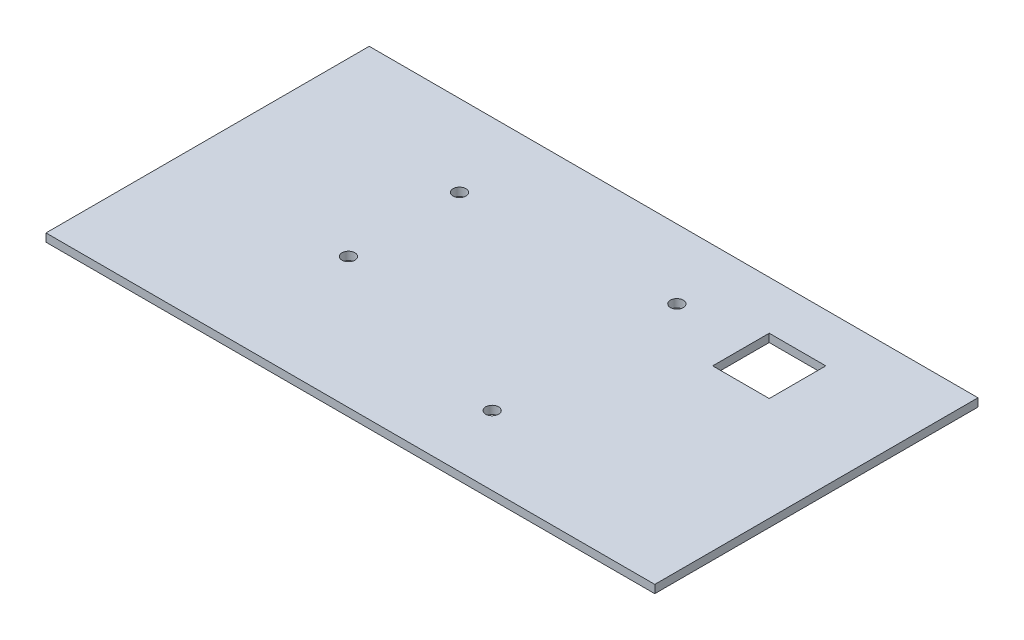
ISO-10303-21;
HEADER;
FILE_DESCRIPTION(('STEP AP214'),'2;1');
FILE_NAME('part.step','',(''),(''),'','','');
FILE_SCHEMA(('AUTOMOTIVE_DESIGN { 1 0 10303 214 1 1 1 1 }'));
ENDSEC;
DATA;
#1=APPLICATION_CONTEXT('core data for automotive mechanical design processes');
#2=APPLICATION_PROTOCOL_DEFINITION('international standard','automotive_design',2000,#1);
#3=PRODUCT_CONTEXT('',#1,'mechanical');
#4=PRODUCT('Part','Part','',(#3));
#5=PRODUCT_RELATED_PRODUCT_CATEGORY('part','',(#4));
#6=PRODUCT_DEFINITION_FORMATION('','',#4);
#7=PRODUCT_DEFINITION_CONTEXT('part definition',#1,'design');
#8=PRODUCT_DEFINITION('design','',#6,#7);
#9=PRODUCT_DEFINITION_SHAPE('','',#8);
#10=(LENGTH_UNIT() NAMED_UNIT(*) SI_UNIT(.MILLI.,.METRE.));
#11=(NAMED_UNIT(*) PLANE_ANGLE_UNIT() SI_UNIT($,.RADIAN.));
#12=(NAMED_UNIT(*) SI_UNIT($,.STERADIAN.) SOLID_ANGLE_UNIT());
#13=UNCERTAINTY_MEASURE_WITH_UNIT(LENGTH_MEASURE(1.E-05),#10,'distance_accuracy_value','');
#14=(GEOMETRIC_REPRESENTATION_CONTEXT(3) GLOBAL_UNCERTAINTY_ASSIGNED_CONTEXT((#13)) GLOBAL_UNIT_ASSIGNED_CONTEXT((#10,
#11,#12)) REPRESENTATION_CONTEXT('',''));
#15=CARTESIAN_POINT('',(0.,0.,0.));
#16=DIRECTION('',(0.,0.,1.));
#17=DIRECTION('',(1.,0.,0.));
#18=AXIS2_PLACEMENT_3D('',#15,#16,#17);
#19=CARTESIAN_POINT('',(44.48,108.,20.1445039595256));
#20=DIRECTION('',(0.,1.,0.));
#21=DIRECTION('',(0.,0.,1.));
#22=AXIS2_PLACEMENT_3D('',#19,#20,#21);
#23=CYLINDRICAL_SURFACE('',#22,1.6);
#24=CARTESIAN_POINT('',(44.48,108.,20.1445039595256));
#25=DIRECTION('',(0.,1.,0.));
#26=DIRECTION('',(0.,0.,1.));
#27=AXIS2_PLACEMENT_3D('',#24,#25,#26);
#28=CIRCLE('',#27,1.6);
#29=CARTESIAN_POINT('',(44.48,108.,21.7445039595255));
#30=VERTEX_POINT('',#29);
#31=EDGE_CURVE('E207',#30,#30,#28,.T.);
#32=ORIENTED_EDGE('',*,*,#31,.F.);
#33=EDGE_LOOP('',(#32));
#34=FACE_BOUND('',#33,.T.);
#35=CARTESIAN_POINT('',(44.48,110.,20.1445039595256));
#36=DIRECTION('',(0.,1.,0.));
#37=DIRECTION('',(0.,0.,1.));
#38=AXIS2_PLACEMENT_3D('',#35,#36,#37);
#39=CIRCLE('',#38,1.6);
#40=CARTESIAN_POINT('',(44.48,110.,21.7445039595255));
#41=VERTEX_POINT('',#40);
#42=EDGE_CURVE('E187',#41,#41,#39,.T.);
#43=ORIENTED_EDGE('',*,*,#42,.T.);
#44=EDGE_LOOP('',(#43));
#45=FACE_BOUND('',#44,.T.);
#46=ADVANCED_FACE('F38',(#34,#45),#23,.F.);
#47=CARTESIAN_POINT('',(95.28,108.,17.14));
#48=DIRECTION('',(0.,1.,0.));
#49=DIRECTION('',(0.,0.,1.));
#50=AXIS2_PLACEMENT_3D('',#47,#48,#49);
#51=CYLINDRICAL_SURFACE('',#50,1.6);
#52=CARTESIAN_POINT('',(95.28,108.,17.14));
#53=DIRECTION('',(0.,1.,0.));
#54=DIRECTION('',(0.,0.,1.));
#55=AXIS2_PLACEMENT_3D('',#52,#53,#54);
#56=CIRCLE('',#55,1.6);
#57=CARTESIAN_POINT('',(95.28,108.,18.74));
#58=VERTEX_POINT('',#57);
#59=EDGE_CURVE('E188',#58,#58,#56,.T.);
#60=ORIENTED_EDGE('',*,*,#59,.F.);
#61=EDGE_LOOP('',(#60));
#62=FACE_BOUND('',#61,.T.);
#63=CARTESIAN_POINT('',(95.28,110.,17.14));
#64=DIRECTION('',(0.,1.,0.));
#65=DIRECTION('',(0.,0.,1.));
#66=AXIS2_PLACEMENT_3D('',#63,#64,#65);
#67=CIRCLE('',#66,1.6);
#68=CARTESIAN_POINT('',(95.28,110.,18.74));
#69=VERTEX_POINT('',#68);
#70=EDGE_CURVE('E183',#69,#69,#67,.T.);
#71=ORIENTED_EDGE('',*,*,#70,.T.);
#72=EDGE_LOOP('',(#71));
#73=FACE_BOUND('',#72,.T.);
#74=ADVANCED_FACE('F244',(#62,#73),#51,.F.);
#75=CARTESIAN_POINT('',(44.48,108.,47.62));
#76=DIRECTION('',(0.,1.,0.));
#77=DIRECTION('',(0.,0.,1.));
#78=AXIS2_PLACEMENT_3D('',#75,#76,#77);
#79=CYLINDRICAL_SURFACE('',#78,1.6);
#80=CARTESIAN_POINT('',(44.48,108.,47.62));
#81=DIRECTION('',(0.,1.,0.));
#82=DIRECTION('',(0.,0.,1.));
#83=AXIS2_PLACEMENT_3D('',#80,#81,#82);
#84=CIRCLE('',#83,1.6);
#85=CARTESIAN_POINT('',(44.48,108.,49.22));
#86=VERTEX_POINT('',#85);
#87=EDGE_CURVE('E196',#86,#86,#84,.T.);
#88=ORIENTED_EDGE('',*,*,#87,.F.);
#89=EDGE_LOOP('',(#88));
#90=FACE_BOUND('',#89,.T.);
#91=CARTESIAN_POINT('',(44.48,110.,47.62));
#92=DIRECTION('',(0.,1.,0.));
#93=DIRECTION('',(0.,0.,1.));
#94=AXIS2_PLACEMENT_3D('',#91,#92,#93);
#95=CIRCLE('',#94,1.6);
#96=CARTESIAN_POINT('',(44.48,110.,49.22));
#97=VERTEX_POINT('',#96);
#98=EDGE_CURVE('E192',#97,#97,#95,.T.);
#99=ORIENTED_EDGE('',*,*,#98,.T.);
#100=EDGE_LOOP('',(#99));
#101=FACE_BOUND('',#100,.T.);
#102=ADVANCED_FACE('F249',(#90,#101),#79,.F.);
#103=CARTESIAN_POINT('',(95.28,108.,62.86));
#104=DIRECTION('',(0.,1.,0.));
#105=DIRECTION('',(0.,0.,1.));
#106=AXIS2_PLACEMENT_3D('',#103,#104,#105);
#107=CYLINDRICAL_SURFACE('',#106,1.60000000000001);
#108=CARTESIAN_POINT('',(95.28,108.,62.86));
#109=DIRECTION('',(0.,1.,0.));
#110=DIRECTION('',(0.,0.,1.));
#111=AXIS2_PLACEMENT_3D('',#108,#109,#110);
#112=CIRCLE('',#111,1.60000000000001);
#113=CARTESIAN_POINT('',(95.28,108.,64.46));
#114=VERTEX_POINT('',#113);
#115=EDGE_CURVE('E174',#114,#114,#112,.T.);
#116=ORIENTED_EDGE('',*,*,#115,.F.);
#117=EDGE_LOOP('',(#116));
#118=FACE_BOUND('',#117,.T.);
#119=CARTESIAN_POINT('',(95.28,110.,62.86));
#120=DIRECTION('',(0.,1.,0.));
#121=DIRECTION('',(0.,0.,1.));
#122=AXIS2_PLACEMENT_3D('',#119,#120,#121);
#123=CIRCLE('',#122,1.60000000000001);
#124=CARTESIAN_POINT('',(95.28,110.,64.46));
#125=VERTEX_POINT('',#124);
#126=EDGE_CURVE('E200',#125,#125,#123,.T.);
#127=ORIENTED_EDGE('',*,*,#126,.T.);
#128=EDGE_LOOP('',(#127));
#129=FACE_BOUND('',#128,.T.);
#130=ADVANCED_FACE('F255',(#118,#129),#107,.F.);
#131=CARTESIAN_POINT('',(113.,108.,26.));
#132=DIRECTION('',(-1.,0.,0.));
#133=DIRECTION('',(0.,0.,1.));
#134=AXIS2_PLACEMENT_3D('',#131,#132,#133);
#135=PLANE('',#134);
#136=DIRECTION('',(0.,0.,1.));
#137=VECTOR('',#136,1.);
#138=CARTESIAN_POINT('',(113.,110.,26.));
#139=LINE('',#138,#137);
#140=CARTESIAN_POINT('',(113.,110.,12.));
#141=VERTEX_POINT('',#140);
#142=CARTESIAN_POINT('',(113.,110.,26.));
#143=VERTEX_POINT('',#142);
#144=EDGE_CURVE('E164',#141,#143,#139,.T.);
#145=ORIENTED_EDGE('',*,*,#144,.T.);
#146=DIRECTION('',(0.,1.,0.));
#147=VECTOR('',#146,1.);
#148=CARTESIAN_POINT('',(113.,108.,26.));
#149=LINE('',#148,#147);
#150=CARTESIAN_POINT('',(113.,108.,26.));
#151=VERTEX_POINT('',#150);
#152=EDGE_CURVE('E175',#151,#143,#149,.T.);
#153=ORIENTED_EDGE('',*,*,#152,.F.);
#154=DIRECTION('',(0.,0.,1.));
#155=VECTOR('',#154,1.);
#156=CARTESIAN_POINT('',(113.,108.,26.));
#157=LINE('',#156,#155);
#158=CARTESIAN_POINT('',(113.,108.,12.));
#159=VERTEX_POINT('',#158);
#160=EDGE_CURVE('E62',#159,#151,#157,.T.);
#161=ORIENTED_EDGE('',*,*,#160,.F.);
#162=DIRECTION('',(0.,1.,0.));
#163=VECTOR('',#162,1.);
#164=CARTESIAN_POINT('',(113.,108.,12.));
#165=LINE('',#164,#163);
#166=EDGE_CURVE('E178',#159,#141,#165,.T.);
#167=ORIENTED_EDGE('',*,*,#166,.T.);
#168=EDGE_LOOP('',(#145,#153,#161,#167));
#169=FACE_BOUND('',#168,.T.);
#170=ADVANCED_FACE('F258',(#169),#135,.F.);
#171=CARTESIAN_POINT('',(113.,108.,12.));
#172=DIRECTION('',(0.,0.,-1.));
#173=DIRECTION('',(-1.,0.,0.));
#174=AXIS2_PLACEMENT_3D('',#171,#172,#173);
#175=PLANE('',#174);
#176=DIRECTION('',(-1.,0.,0.));
#177=VECTOR('',#176,1.);
#178=CARTESIAN_POINT('',(113.,110.,12.));
#179=LINE('',#178,#177);
#180=CARTESIAN_POINT('',(127.,110.,12.));
#181=VERTEX_POINT('',#180);
#182=EDGE_CURVE('E160',#181,#141,#179,.T.);
#183=ORIENTED_EDGE('',*,*,#182,.T.);
#184=ORIENTED_EDGE('',*,*,#166,.F.);
#185=DIRECTION('',(-1.,0.,0.));
#186=VECTOR('',#185,1.);
#187=CARTESIAN_POINT('',(113.,108.,12.));
#188=LINE('',#187,#186);
#189=CARTESIAN_POINT('',(127.,108.,12.));
#190=VERTEX_POINT('',#189);
#191=EDGE_CURVE('E146',#190,#159,#188,.T.);
#192=ORIENTED_EDGE('',*,*,#191,.F.);
#193=DIRECTION('',(0.,1.,0.));
#194=VECTOR('',#193,1.);
#195=CARTESIAN_POINT('',(127.,108.,12.));
#196=LINE('',#195,#194);
#197=EDGE_CURVE('E157',#190,#181,#196,.T.);
#198=ORIENTED_EDGE('',*,*,#197,.T.);
#199=EDGE_LOOP('',(#183,#184,#192,#198));
#200=FACE_BOUND('',#199,.T.);
#201=ADVANCED_FACE('F266',(#200),#175,.F.);
#202=CARTESIAN_POINT('',(127.,108.,26.));
#203=DIRECTION('',(1.,0.,0.));
#204=DIRECTION('',(0.,0.,-1.));
#205=AXIS2_PLACEMENT_3D('',#202,#203,#204);
#206=PLANE('',#205);
#207=DIRECTION('',(0.,0.,-1.));
#208=VECTOR('',#207,1.);
#209=CARTESIAN_POINT('',(127.,110.,26.));
#210=LINE('',#209,#208);
#211=CARTESIAN_POINT('',(127.,110.,26.));
#212=VERTEX_POINT('',#211);
#213=EDGE_CURVE('E54',#212,#181,#210,.T.);
#214=ORIENTED_EDGE('',*,*,#213,.T.);
#215=ORIENTED_EDGE('',*,*,#197,.F.);
#216=DIRECTION('',(0.,0.,-1.));
#217=VECTOR('',#216,1.);
#218=CARTESIAN_POINT('',(127.,108.,26.));
#219=LINE('',#218,#217);
#220=CARTESIAN_POINT('',(127.,108.,26.));
#221=VERTEX_POINT('',#220);
#222=EDGE_CURVE('E142',#221,#190,#219,.T.);
#223=ORIENTED_EDGE('',*,*,#222,.F.);
#224=DIRECTION('',(0.,1.,0.));
#225=VECTOR('',#224,1.);
#226=CARTESIAN_POINT('',(127.,108.,26.));
#227=LINE('',#226,#225);
#228=EDGE_CURVE('E171',#221,#212,#227,.T.);
#229=ORIENTED_EDGE('',*,*,#228,.T.);
#230=EDGE_LOOP('',(#214,#215,#223,#229));
#231=FACE_BOUND('',#230,.T.);
#232=ADVANCED_FACE('F263',(#231),#206,.F.);
#233=CARTESIAN_POINT('',(113.,108.,26.));
#234=DIRECTION('',(0.,0.,1.));
#235=DIRECTION('',(1.,0.,0.));
#236=AXIS2_PLACEMENT_3D('',#233,#234,#235);
#237=PLANE('',#236);
#238=DIRECTION('',(1.,0.,0.));
#239=VECTOR('',#238,1.);
#240=CARTESIAN_POINT('',(113.,110.,26.));
#241=LINE('',#240,#239);
#242=EDGE_CURVE('E147',#143,#212,#241,.T.);
#243=ORIENTED_EDGE('',*,*,#242,.T.);
#244=ORIENTED_EDGE('',*,*,#228,.F.);
#245=DIRECTION('',(1.,0.,0.));
#246=VECTOR('',#245,1.);
#247=CARTESIAN_POINT('',(113.,108.,26.));
#248=LINE('',#247,#246);
#249=EDGE_CURVE('E153',#151,#221,#248,.T.);
#250=ORIENTED_EDGE('',*,*,#249,.F.);
#251=ORIENTED_EDGE('',*,*,#152,.T.);
#252=EDGE_LOOP('',(#243,#244,#250,#251));
#253=FACE_BOUND('',#252,.T.);
#254=ADVANCED_FACE('F238',(#253),#237,.F.);
#255=CARTESIAN_POINT('',(152.672892957865,0.,0.));
#256=DIRECTION('',(-1.,0.,0.));
#257=DIRECTION('',(0.,0.,1.));
#258=AXIS2_PLACEMENT_3D('',#255,#256,#257);
#259=PLANE('',#258);
#260=DIRECTION('',(0.,-1.,0.));
#261=VECTOR('',#260,1.);
#262=CARTESIAN_POINT('',(152.672892957865,0.,80.));
#263=LINE('',#262,#261);
#264=CARTESIAN_POINT('',(152.672892957865,110.,80.));
#265=VERTEX_POINT('',#264);
#266=CARTESIAN_POINT('',(152.672892957865,108.,80.));
#267=VERTEX_POINT('',#266);
#268=EDGE_CURVE('E114',#265,#267,#263,.T.);
#269=ORIENTED_EDGE('',*,*,#268,.T.);
#270=DIRECTION('',(0.,0.,1.));
#271=VECTOR('',#270,1.);
#272=CARTESIAN_POINT('',(152.672892957865,108.,0.));
#273=LINE('',#272,#271);
#274=CARTESIAN_POINT('',(152.672892957865,108.,0.));
#275=VERTEX_POINT('',#274);
#276=EDGE_CURVE('E141',#275,#267,#273,.T.);
#277=ORIENTED_EDGE('',*,*,#276,.F.);
#278=DIRECTION('',(0.,-1.,0.));
#279=VECTOR('',#278,1.);
#280=CARTESIAN_POINT('',(152.672892957865,0.,0.));
#281=LINE('',#280,#279);
#282=CARTESIAN_POINT('',(152.672892957865,110.,0.));
#283=VERTEX_POINT('',#282);
#284=EDGE_CURVE('E131',#283,#275,#281,.T.);
#285=ORIENTED_EDGE('',*,*,#284,.F.);
#286=DIRECTION('',(0.,0.,1.));
#287=VECTOR('',#286,1.);
#288=CARTESIAN_POINT('',(152.672892957865,110.,0.));
#289=LINE('',#288,#287);
#290=EDGE_CURVE('E135',#283,#265,#289,.T.);
#291=ORIENTED_EDGE('',*,*,#290,.T.);
#292=EDGE_LOOP('',(#269,#277,#285,#291));
#293=FACE_BOUND('',#292,.T.);
#294=ADVANCED_FACE('F222',(#293),#259,.F.);
#295=CARTESIAN_POINT('',(153.,108.,2.));
#296=DIRECTION('',(0.,1.,0.));
#297=DIRECTION('',(0.,0.,1.));
#298=AXIS2_PLACEMENT_3D('',#295,#296,#297);
#299=PLANE('',#298);
#300=ORIENTED_EDGE('',*,*,#249,.T.);
#301=ORIENTED_EDGE('',*,*,#222,.T.);
#302=ORIENTED_EDGE('',*,*,#191,.T.);
#303=ORIENTED_EDGE('',*,*,#160,.T.);
#304=EDGE_LOOP('',(#300,#301,#302,#303));
#305=FACE_BOUND('',#304,.T.);
#306=ORIENTED_EDGE('',*,*,#115,.T.);
#307=EDGE_LOOP('',(#306));
#308=FACE_BOUND('',#307,.T.);
#309=ORIENTED_EDGE('',*,*,#87,.T.);
#310=EDGE_LOOP('',(#309));
#311=FACE_BOUND('',#310,.T.);
#312=ORIENTED_EDGE('',*,*,#59,.T.);
#313=EDGE_LOOP('',(#312));
#314=FACE_BOUND('',#313,.T.);
#315=ORIENTED_EDGE('',*,*,#31,.T.);
#316=EDGE_LOOP('',(#315));
#317=FACE_BOUND('',#316,.T.);
#318=DIRECTION('',(1.,0.,0.));
#319=VECTOR('',#318,1.);
#320=CARTESIAN_POINT('',(0.,108.,0.));
#321=LINE('',#320,#319);
#322=CARTESIAN_POINT('',(2.,108.,0.));
#323=VERTEX_POINT('',#322);
#324=EDGE_CURVE('E122',#323,#275,#321,.T.);
#325=ORIENTED_EDGE('',*,*,#324,.T.);
#326=ORIENTED_EDGE('',*,*,#276,.T.);
#327=DIRECTION('',(-1.,0.,0.));
#328=VECTOR('',#327,1.);
#329=CARTESIAN_POINT('',(153.,108.,80.));
#330=LINE('',#329,#328);
#331=CARTESIAN_POINT('',(2.,108.,80.));
#332=VERTEX_POINT('',#331);
#333=EDGE_CURVE('E127',#267,#332,#330,.T.);
#334=ORIENTED_EDGE('',*,*,#333,.T.);
#335=DIRECTION('',(0.,0.,1.));
#336=VECTOR('',#335,1.);
#337=CARTESIAN_POINT('',(2.,108.,2.));
#338=LINE('',#337,#336);
#339=EDGE_CURVE('E108',#323,#332,#338,.T.);
#340=ORIENTED_EDGE('',*,*,#339,.F.);
#341=EDGE_LOOP('',(#325,#326,#334,#340));
#342=FACE_BOUND('',#341,.T.);
#343=ADVANCED_FACE('F229',(#305,#308,#311,#314,#317,#342),#299,.F.);
#344=CARTESIAN_POINT('',(0.,0.,0.));
#345=DIRECTION('',(0.,0.,1.));
#346=DIRECTION('',(1.,0.,0.));
#347=AXIS2_PLACEMENT_3D('',#344,#345,#346);
#348=PLANE('',#347);
#349=ORIENTED_EDGE('',*,*,#324,.F.);
#350=DIRECTION('',(0.,-1.,0.));
#351=VECTOR('',#350,1.);
#352=CARTESIAN_POINT('',(2.,110.,0.));
#353=LINE('',#352,#351);
#354=CARTESIAN_POINT('',(2.,110.,0.));
#355=VERTEX_POINT('',#354);
#356=EDGE_CURVE('E115',#355,#323,#353,.T.);
#357=ORIENTED_EDGE('',*,*,#356,.F.);
#358=DIRECTION('',(1.,0.,0.));
#359=VECTOR('',#358,1.);
#360=CARTESIAN_POINT('',(0.,110.,0.));
#361=LINE('',#360,#359);
#362=EDGE_CURVE('E42',#355,#283,#361,.T.);
#363=ORIENTED_EDGE('',*,*,#362,.T.);
#364=ORIENTED_EDGE('',*,*,#284,.T.);
#365=EDGE_LOOP('',(#349,#357,#363,#364));
#366=FACE_BOUND('',#365,.T.);
#367=ADVANCED_FACE('F221',(#366),#348,.F.);
#368=CARTESIAN_POINT('',(0.,0.,80.));
#369=DIRECTION('',(0.,0.,1.));
#370=DIRECTION('',(1.,0.,0.));
#371=AXIS2_PLACEMENT_3D('',#368,#369,#370);
#372=PLANE('',#371);
#373=DIRECTION('',(1.,0.,0.));
#374=VECTOR('',#373,1.);
#375=CARTESIAN_POINT('',(0.,110.,80.));
#376=LINE('',#375,#374);
#377=CARTESIAN_POINT('',(2.,110.,80.));
#378=VERTEX_POINT('',#377);
#379=EDGE_CURVE('E11',#378,#265,#376,.T.);
#380=ORIENTED_EDGE('',*,*,#379,.F.);
#381=DIRECTION('',(0.,-1.,0.));
#382=VECTOR('',#381,1.);
#383=CARTESIAN_POINT('',(2.,110.,80.));
#384=LINE('',#383,#382);
#385=EDGE_CURVE('E102',#378,#332,#384,.T.);
#386=ORIENTED_EDGE('',*,*,#385,.T.);
#387=ORIENTED_EDGE('',*,*,#333,.F.);
#388=ORIENTED_EDGE('',*,*,#268,.F.);
#389=EDGE_LOOP('',(#380,#386,#387,#388));
#390=FACE_BOUND('',#389,.T.);
#391=ADVANCED_FACE('F125',(#390),#372,.T.);
#392=CARTESIAN_POINT('',(0.,110.,80.));
#393=DIRECTION('',(0.,1.,0.));
#394=DIRECTION('',(0.,0.,1.));
#395=AXIS2_PLACEMENT_3D('',#392,#393,#394);
#396=PLANE('',#395);
#397=ORIENTED_EDGE('',*,*,#213,.F.);
#398=ORIENTED_EDGE('',*,*,#242,.F.);
#399=ORIENTED_EDGE('',*,*,#144,.F.);
#400=ORIENTED_EDGE('',*,*,#182,.F.);
#401=EDGE_LOOP('',(#397,#398,#399,#400));
#402=FACE_BOUND('',#401,.T.);
#403=ORIENTED_EDGE('',*,*,#126,.F.);
#404=EDGE_LOOP('',(#403));
#405=FACE_BOUND('',#404,.T.);
#406=ORIENTED_EDGE('',*,*,#98,.F.);
#407=EDGE_LOOP('',(#406));
#408=FACE_BOUND('',#407,.T.);
#409=ORIENTED_EDGE('',*,*,#70,.F.);
#410=EDGE_LOOP('',(#409));
#411=FACE_BOUND('',#410,.T.);
#412=ORIENTED_EDGE('',*,*,#42,.F.);
#413=EDGE_LOOP('',(#412));
#414=FACE_BOUND('',#413,.T.);
#415=ORIENTED_EDGE('',*,*,#362,.F.);
#416=DIRECTION('',(0.,0.,1.));
#417=VECTOR('',#416,1.);
#418=CARTESIAN_POINT('',(2.,110.,0.));
#419=LINE('',#418,#417);
#420=EDGE_CURVE('E106',#355,#378,#419,.T.);
#421=ORIENTED_EDGE('',*,*,#420,.T.);
#422=ORIENTED_EDGE('',*,*,#379,.T.);
#423=ORIENTED_EDGE('',*,*,#290,.F.);
#424=EDGE_LOOP('',(#415,#421,#422,#423));
#425=FACE_BOUND('',#424,.T.);
#426=ADVANCED_FACE('F40',(#402,#405,#408,#411,#414,#425),#396,.T.);
#427=CARTESIAN_POINT('',(2.,110.,0.));
#428=DIRECTION('',(-1.,0.,0.));
#429=DIRECTION('',(0.,0.,1.));
#430=AXIS2_PLACEMENT_3D('',#427,#428,#429);
#431=PLANE('',#430);
#432=ORIENTED_EDGE('',*,*,#356,.T.);
#433=ORIENTED_EDGE('',*,*,#339,.T.);
#434=ORIENTED_EDGE('',*,*,#385,.F.);
#435=ORIENTED_EDGE('',*,*,#420,.F.);
#436=EDGE_LOOP('',(#432,#433,#434,#435));
#437=FACE_BOUND('',#436,.T.);
#438=ADVANCED_FACE('F105',(#437),#431,.T.);
#439=CLOSED_SHELL('',(#46,#74,#102,#130,#170,#201,#232,#254,#294,#343,#367,#391,#426,#438));
#440=MANIFOLD_SOLID_BREP('B2',#439);
#441=ADVANCED_BREP_SHAPE_REPRESENTATION('',(#18,#440),#14);
#442=SHAPE_DEFINITION_REPRESENTATION(#9,#441);
ENDSEC;
END-ISO-10303-21;
